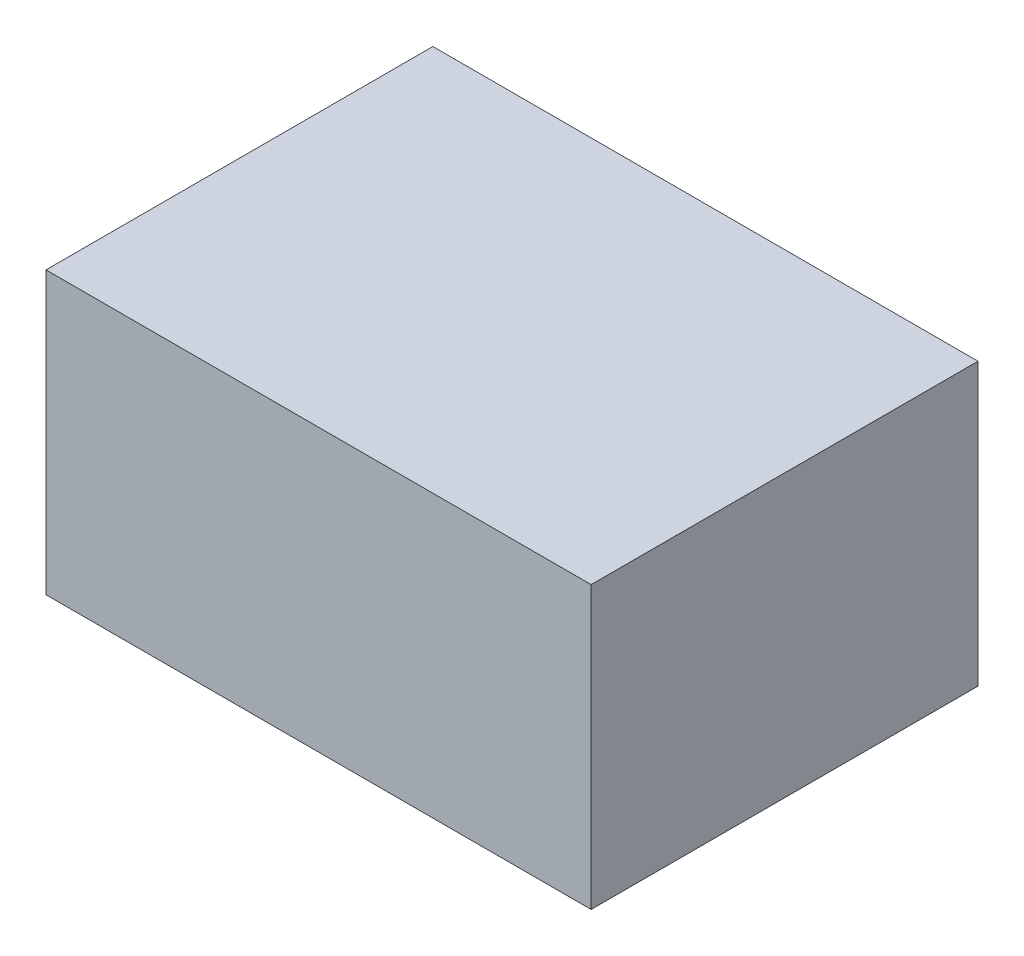
ISO-10303-21;
HEADER;
FILE_DESCRIPTION(('STEP AP214'),'2;1');
FILE_NAME('part.step','',(''),(''),'','','');
FILE_SCHEMA(('AUTOMOTIVE_DESIGN { 1 0 10303 214 1 1 1 1 }'));
ENDSEC;
DATA;
#1=APPLICATION_CONTEXT('core data for automotive mechanical design processes');
#2=APPLICATION_PROTOCOL_DEFINITION('international standard','automotive_design',2000,#1);
#3=PRODUCT_CONTEXT('',#1,'mechanical');
#4=PRODUCT('Part','Part','',(#3));
#5=PRODUCT_RELATED_PRODUCT_CATEGORY('part','',(#4));
#6=PRODUCT_DEFINITION_FORMATION('','',#4);
#7=PRODUCT_DEFINITION_CONTEXT('part definition',#1,'design');
#8=PRODUCT_DEFINITION('design','',#6,#7);
#9=PRODUCT_DEFINITION_SHAPE('','',#8);
#10=(LENGTH_UNIT() NAMED_UNIT(*) SI_UNIT(.MILLI.,.METRE.));
#11=(NAMED_UNIT(*) PLANE_ANGLE_UNIT() SI_UNIT($,.RADIAN.));
#12=(NAMED_UNIT(*) SI_UNIT($,.STERADIAN.) SOLID_ANGLE_UNIT());
#13=UNCERTAINTY_MEASURE_WITH_UNIT(LENGTH_MEASURE(1.E-05),#10,'distance_accuracy_value','');
#14=(GEOMETRIC_REPRESENTATION_CONTEXT(3) GLOBAL_UNCERTAINTY_ASSIGNED_CONTEXT((#13)) GLOBAL_UNIT_ASSIGNED_CONTEXT((#10,
#11,#12)) REPRESENTATION_CONTEXT('',''));
#15=CARTESIAN_POINT('',(0.,0.,0.));
#16=DIRECTION('',(0.,0.,1.));
#17=DIRECTION('',(1.,0.,0.));
#18=AXIS2_PLACEMENT_3D('',#15,#16,#17);
#19=CARTESIAN_POINT('',(2.94352816966875,32.,28.5647926406968));
#20=DIRECTION('',(-1.,0.,0.));
#21=DIRECTION('',(0.,0.,1.));
#22=AXIS2_PLACEMENT_3D('',#19,#20,#21);
#23=PLANE('',#22);
#24=DIRECTION('',(0.,0.,-1.));
#25=VECTOR('',#24,1.);
#26=CARTESIAN_POINT('',(2.94352816966875,0.,28.5647926406968));
#27=LINE('',#26,#25);
#28=CARTESIAN_POINT('',(2.94352816966875,0.,28.5647926406968));
#29=VERTEX_POINT('',#28);
#30=CARTESIAN_POINT('',(2.94352816966875,0.,-15.4352073593031));
#31=VERTEX_POINT('',#30);
#32=EDGE_CURVE('E107',#29,#31,#27,.T.);
#33=ORIENTED_EDGE('',*,*,#32,.T.);
#34=DIRECTION('',(0.,-1.,0.));
#35=VECTOR('',#34,1.);
#36=CARTESIAN_POINT('',(2.94352816966875,32.,-15.4352073593031));
#37=LINE('',#36,#35);
#38=CARTESIAN_POINT('',(2.94352816966875,32.,-15.4352073593031));
#39=VERTEX_POINT('',#38);
#40=EDGE_CURVE('E11',#39,#31,#37,.T.);
#41=ORIENTED_EDGE('',*,*,#40,.F.);
#42=DIRECTION('',(0.,0.,-1.));
#43=VECTOR('',#42,1.);
#44=CARTESIAN_POINT('',(2.94352816966875,32.,28.5647926406968));
#45=LINE('',#44,#43);
#46=CARTESIAN_POINT('',(2.94352816966875,32.,28.5647926406968));
#47=VERTEX_POINT('',#46);
#48=EDGE_CURVE('E91',#47,#39,#45,.T.);
#49=ORIENTED_EDGE('',*,*,#48,.F.);
#50=DIRECTION('',(0.,-1.,0.));
#51=VECTOR('',#50,1.);
#52=CARTESIAN_POINT('',(2.94352816966875,32.,28.5647926406968));
#53=LINE('',#52,#51);
#54=EDGE_CURVE('E103',#47,#29,#53,.T.);
#55=ORIENTED_EDGE('',*,*,#54,.T.);
#56=EDGE_LOOP('',(#33,#41,#49,#55));
#57=FACE_BOUND('',#56,.T.);
#58=ADVANCED_FACE('F39',(#57),#23,.F.);
#59=CARTESIAN_POINT('',(-59.0564718303312,32.,-15.4352073593031));
#60=DIRECTION('',(0.,0.,1.));
#61=DIRECTION('',(1.,0.,0.));
#62=AXIS2_PLACEMENT_3D('',#59,#60,#61);
#63=PLANE('',#62);
#64=DIRECTION('',(-1.,0.,0.));
#65=VECTOR('',#64,1.);
#66=CARTESIAN_POINT('',(-59.0564718303312,0.,-15.4352073593031));
#67=LINE('',#66,#65);
#68=CARTESIAN_POINT('',(-59.0564718303312,0.,-15.4352073593031));
#69=VERTEX_POINT('',#68);
#70=EDGE_CURVE('E96',#31,#69,#67,.T.);
#71=ORIENTED_EDGE('',*,*,#70,.T.);
#72=DIRECTION('',(0.,-1.,0.));
#73=VECTOR('',#72,1.);
#74=CARTESIAN_POINT('',(-59.0564718303312,32.,-15.4352073593031));
#75=LINE('',#74,#73);
#76=CARTESIAN_POINT('',(-59.0564718303312,32.,-15.4352073593031));
#77=VERTEX_POINT('',#76);
#78=EDGE_CURVE('E48',#77,#69,#75,.T.);
#79=ORIENTED_EDGE('',*,*,#78,.F.);
#80=DIRECTION('',(-1.,0.,0.));
#81=VECTOR('',#80,1.);
#82=CARTESIAN_POINT('',(-59.0564718303312,32.,-15.4352073593031));
#83=LINE('',#82,#81);
#84=EDGE_CURVE('E86',#39,#77,#83,.T.);
#85=ORIENTED_EDGE('',*,*,#84,.F.);
#86=ORIENTED_EDGE('',*,*,#40,.T.);
#87=EDGE_LOOP('',(#71,#79,#85,#86));
#88=FACE_BOUND('',#87,.T.);
#89=ADVANCED_FACE('F95',(#88),#63,.F.);
#90=CARTESIAN_POINT('',(-59.0564718303312,32.,28.5647926406968));
#91=DIRECTION('',(1.,0.,0.));
#92=DIRECTION('',(0.,0.,-1.));
#93=AXIS2_PLACEMENT_3D('',#90,#91,#92);
#94=PLANE('',#93);
#95=DIRECTION('',(0.,0.,1.));
#96=VECTOR('',#95,1.);
#97=CARTESIAN_POINT('',(-59.0564718303312,0.,28.5647926406968));
#98=LINE('',#97,#96);
#99=CARTESIAN_POINT('',(-59.0564718303312,0.,28.5647926406968));
#100=VERTEX_POINT('',#99);
#101=EDGE_CURVE('E73',#69,#100,#98,.T.);
#102=ORIENTED_EDGE('',*,*,#101,.T.);
#103=DIRECTION('',(0.,-1.,0.));
#104=VECTOR('',#103,1.);
#105=CARTESIAN_POINT('',(-59.0564718303312,32.,28.5647926406968));
#106=LINE('',#105,#104);
#107=CARTESIAN_POINT('',(-59.0564718303312,32.,28.5647926406968));
#108=VERTEX_POINT('',#107);
#109=EDGE_CURVE('E98',#108,#100,#106,.T.);
#110=ORIENTED_EDGE('',*,*,#109,.F.);
#111=DIRECTION('',(0.,0.,1.));
#112=VECTOR('',#111,1.);
#113=CARTESIAN_POINT('',(-59.0564718303312,32.,28.5647926406968));
#114=LINE('',#113,#112);
#115=EDGE_CURVE('E89',#77,#108,#114,.T.);
#116=ORIENTED_EDGE('',*,*,#115,.F.);
#117=ORIENTED_EDGE('',*,*,#78,.T.);
#118=EDGE_LOOP('',(#102,#110,#116,#117));
#119=FACE_BOUND('',#118,.T.);
#120=ADVANCED_FACE('F99',(#119),#94,.F.);
#121=CARTESIAN_POINT('',(-59.0564718303312,32.,28.5647926406968));
#122=DIRECTION('',(0.,0.,-1.));
#123=DIRECTION('',(-1.,0.,0.));
#124=AXIS2_PLACEMENT_3D('',#121,#122,#123);
#125=PLANE('',#124);
#126=DIRECTION('',(1.,0.,0.));
#127=VECTOR('',#126,1.);
#128=CARTESIAN_POINT('',(-59.0564718303312,0.,28.5647926406968));
#129=LINE('',#128,#127);
#130=EDGE_CURVE('E79',#100,#29,#129,.T.);
#131=ORIENTED_EDGE('',*,*,#130,.T.);
#132=ORIENTED_EDGE('',*,*,#54,.F.);
#133=DIRECTION('',(1.,0.,0.));
#134=VECTOR('',#133,1.);
#135=CARTESIAN_POINT('',(-59.0564718303312,32.,28.5647926406968));
#136=LINE('',#135,#134);
#137=EDGE_CURVE('E56',#108,#47,#136,.T.);
#138=ORIENTED_EDGE('',*,*,#137,.F.);
#139=ORIENTED_EDGE('',*,*,#109,.T.);
#140=EDGE_LOOP('',(#131,#132,#138,#139));
#141=FACE_BOUND('',#140,.T.);
#142=ADVANCED_FACE('F120',(#141),#125,.F.);
#143=CARTESIAN_POINT('',(0.,32.,0.));
#144=DIRECTION('',(0.,-1.,0.));
#145=DIRECTION('',(0.,0.,-1.));
#146=AXIS2_PLACEMENT_3D('',#143,#144,#145);
#147=PLANE('',#146);
#148=ORIENTED_EDGE('',*,*,#48,.T.);
#149=ORIENTED_EDGE('',*,*,#84,.T.);
#150=ORIENTED_EDGE('',*,*,#115,.T.);
#151=ORIENTED_EDGE('',*,*,#137,.T.);
#152=EDGE_LOOP('',(#148,#149,#150,#151));
#153=FACE_BOUND('',#152,.T.);
#154=ADVANCED_FACE('F87',(#153),#147,.F.);
#155=CARTESIAN_POINT('',(0.,0.,0.));
#156=DIRECTION('',(0.,-1.,0.));
#157=DIRECTION('',(0.,0.,-1.));
#158=AXIS2_PLACEMENT_3D('',#155,#156,#157);
#159=PLANE('',#158);
#160=ORIENTED_EDGE('',*,*,#32,.F.);
#161=ORIENTED_EDGE('',*,*,#130,.F.);
#162=ORIENTED_EDGE('',*,*,#101,.F.);
#163=ORIENTED_EDGE('',*,*,#70,.F.);
#164=EDGE_LOOP('',(#160,#161,#162,#163));
#165=FACE_BOUND('',#164,.T.);
#166=ADVANCED_FACE('F123',(#165),#159,.T.);
#167=CLOSED_SHELL('',(#58,#89,#120,#142,#154,#166));
#168=MANIFOLD_SOLID_BREP('B2',#167);
#169=ADVANCED_BREP_SHAPE_REPRESENTATION('',(#18,#168),#14);
#170=SHAPE_DEFINITION_REPRESENTATION(#9,#169);
ENDSEC;
END-ISO-10303-21;
